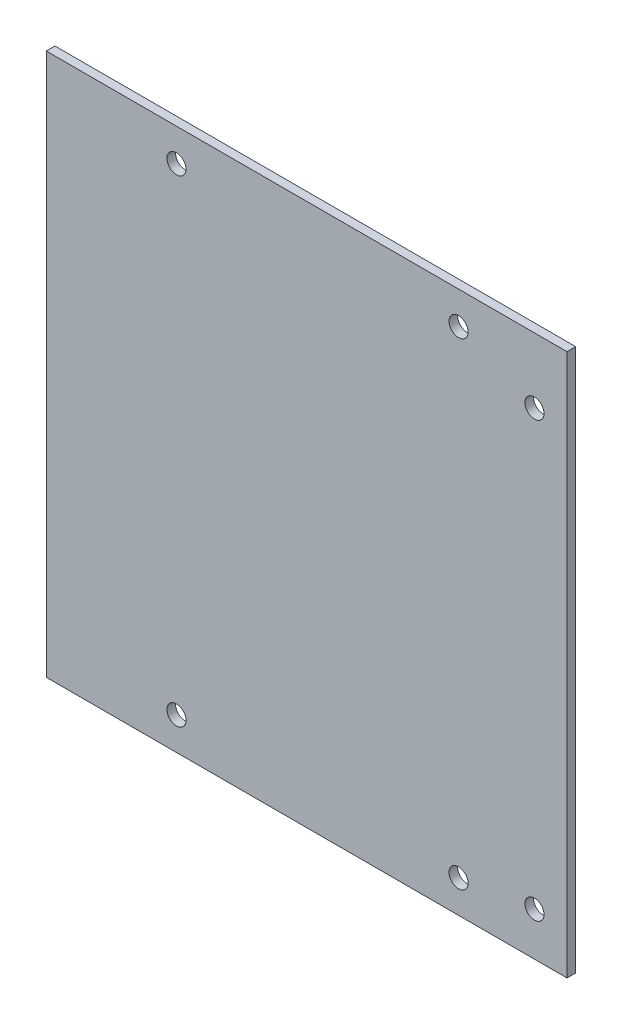
ISO-10303-21;
HEADER;
FILE_DESCRIPTION(('STEP AP214'),'2;1');
FILE_NAME('part.step','',(''),(''),'','','');
FILE_SCHEMA(('AUTOMOTIVE_DESIGN { 1 0 10303 214 1 1 1 1 }'));
ENDSEC;
DATA;
#1=APPLICATION_CONTEXT('core data for automotive mechanical design processes');
#2=APPLICATION_PROTOCOL_DEFINITION('international standard','automotive_design',2000,#1);
#3=PRODUCT_CONTEXT('',#1,'mechanical');
#4=PRODUCT('Part','Part','',(#3));
#5=PRODUCT_RELATED_PRODUCT_CATEGORY('part','',(#4));
#6=PRODUCT_DEFINITION_FORMATION('','',#4);
#7=PRODUCT_DEFINITION_CONTEXT('part definition',#1,'design');
#8=PRODUCT_DEFINITION('design','',#6,#7);
#9=PRODUCT_DEFINITION_SHAPE('','',#8);
#10=(LENGTH_UNIT() NAMED_UNIT(*) SI_UNIT(.MILLI.,.METRE.));
#11=(NAMED_UNIT(*) PLANE_ANGLE_UNIT() SI_UNIT($,.RADIAN.));
#12=(NAMED_UNIT(*) SI_UNIT($,.STERADIAN.) SOLID_ANGLE_UNIT());
#13=UNCERTAINTY_MEASURE_WITH_UNIT(LENGTH_MEASURE(1.E-05),#10,'distance_accuracy_value','');
#14=(GEOMETRIC_REPRESENTATION_CONTEXT(3) GLOBAL_UNCERTAINTY_ASSIGNED_CONTEXT((#13)) GLOBAL_UNIT_ASSIGNED_CONTEXT((#10,
#11,#12)) REPRESENTATION_CONTEXT('',''));
#15=CARTESIAN_POINT('',(0.,0.,0.));
#16=DIRECTION('',(0.,0.,1.));
#17=DIRECTION('',(1.,0.,0.));
#18=AXIS2_PLACEMENT_3D('',#15,#16,#17);
#19=CARTESIAN_POINT('',(70.,62.5,2.));
#20=DIRECTION('',(-1.,0.,0.));
#21=DIRECTION('',(0.,-1.,0.));
#22=AXIS2_PLACEMENT_3D('',#19,#20,#21);
#23=PLANE('',#22);
#24=DIRECTION('',(0.,1.,0.));
#25=VECTOR('',#24,1.);
#26=CARTESIAN_POINT('',(70.,62.5,0.));
#27=LINE('',#26,#25);
#28=CARTESIAN_POINT('',(70.,-62.5,0.));
#29=VERTEX_POINT('',#28);
#30=CARTESIAN_POINT('',(70.,62.5,0.));
#31=VERTEX_POINT('',#30);
#32=EDGE_CURVE('E95',#29,#31,#27,.T.);
#33=ORIENTED_EDGE('',*,*,#32,.T.);
#34=DIRECTION('',(0.,0.,-1.));
#35=VECTOR('',#34,1.);
#36=CARTESIAN_POINT('',(70.,62.5,2.));
#37=LINE('',#36,#35);
#38=CARTESIAN_POINT('',(70.,62.5,2.));
#39=VERTEX_POINT('',#38);
#40=EDGE_CURVE('E11',#39,#31,#37,.T.);
#41=ORIENTED_EDGE('',*,*,#40,.F.);
#42=DIRECTION('',(0.,1.,0.));
#43=VECTOR('',#42,1.);
#44=CARTESIAN_POINT('',(70.,62.5,2.));
#45=LINE('',#44,#43);
#46=CARTESIAN_POINT('',(70.,-62.5,2.));
#47=VERTEX_POINT('',#46);
#48=EDGE_CURVE('E89',#47,#39,#45,.T.);
#49=ORIENTED_EDGE('',*,*,#48,.F.);
#50=DIRECTION('',(0.,0.,-1.));
#51=VECTOR('',#50,1.);
#52=CARTESIAN_POINT('',(70.,-62.5,2.));
#53=LINE('',#52,#51);
#54=EDGE_CURVE('E48',#47,#29,#53,.T.);
#55=ORIENTED_EDGE('',*,*,#54,.T.);
#56=EDGE_LOOP('',(#33,#41,#49,#55));
#57=FACE_BOUND('',#56,.T.);
#58=ADVANCED_FACE('F39',(#57),#23,.F.);
#59=CARTESIAN_POINT('',(-70.,62.5,2.));
#60=DIRECTION('',(0.,-1.,0.));
#61=DIRECTION('',(0.,0.,-1.));
#62=AXIS2_PLACEMENT_3D('',#59,#60,#61);
#63=PLANE('',#62);
#64=DIRECTION('',(-1.,0.,0.));
#65=VECTOR('',#64,1.);
#66=CARTESIAN_POINT('',(-70.,62.5,0.));
#67=LINE('',#66,#65);
#68=CARTESIAN_POINT('',(-50.,62.5,0.));
#69=VERTEX_POINT('',#68);
#70=EDGE_CURVE('E90',#31,#69,#67,.T.);
#71=ORIENTED_EDGE('',*,*,#70,.T.);
#72=DIRECTION('',(0.,0.,-1.));
#73=VECTOR('',#72,1.);
#74=CARTESIAN_POINT('',(-50.,62.5,2.));
#75=LINE('',#74,#73);
#76=CARTESIAN_POINT('',(-50.,62.5,2.));
#77=VERTEX_POINT('',#76);
#78=EDGE_CURVE('E56',#77,#69,#75,.T.);
#79=ORIENTED_EDGE('',*,*,#78,.F.);
#80=DIRECTION('',(-1.,0.,0.));
#81=VECTOR('',#80,1.);
#82=CARTESIAN_POINT('',(-70.,62.5,2.));
#83=LINE('',#82,#81);
#84=EDGE_CURVE('E142',#39,#77,#83,.T.);
#85=ORIENTED_EDGE('',*,*,#84,.F.);
#86=ORIENTED_EDGE('',*,*,#40,.T.);
#87=EDGE_LOOP('',(#71,#79,#85,#86));
#88=FACE_BOUND('',#87,.T.);
#89=ADVANCED_FACE('F152',(#88),#63,.F.);
#90=CARTESIAN_POINT('',(-70.,-62.5,2.));
#91=DIRECTION('',(0.,1.,0.));
#92=DIRECTION('',(0.,0.,1.));
#93=AXIS2_PLACEMENT_3D('',#90,#91,#92);
#94=PLANE('',#93);
#95=DIRECTION('',(1.,0.,0.));
#96=VECTOR('',#95,1.);
#97=CARTESIAN_POINT('',(-70.,-62.5,2.));
#98=LINE('',#97,#96);
#99=CARTESIAN_POINT('',(-50.,-62.5,2.00000000000002));
#100=VERTEX_POINT('',#99);
#101=EDGE_CURVE('E65',#100,#47,#98,.T.);
#102=ORIENTED_EDGE('',*,*,#101,.F.);
#103=DIRECTION('',(0.,0.,1.));
#104=VECTOR('',#103,1.);
#105=CARTESIAN_POINT('',(-50.,-62.5,2.00000000000002));
#106=LINE('',#105,#104);
#107=CARTESIAN_POINT('',(-50.,-62.5,0.));
#108=VERTEX_POINT('',#107);
#109=EDGE_CURVE('E85',#108,#100,#106,.T.);
#110=ORIENTED_EDGE('',*,*,#109,.F.);
#111=DIRECTION('',(1.,0.,0.));
#112=VECTOR('',#111,1.);
#113=CARTESIAN_POINT('',(-70.,-62.5,0.));
#114=LINE('',#113,#112);
#115=EDGE_CURVE('E79',#108,#29,#114,.T.);
#116=ORIENTED_EDGE('',*,*,#115,.T.);
#117=ORIENTED_EDGE('',*,*,#54,.F.);
#118=EDGE_LOOP('',(#102,#110,#116,#117));
#119=FACE_BOUND('',#118,.T.);
#120=ADVANCED_FACE('F81',(#119),#94,.F.);
#121=CARTESIAN_POINT('',(0.,0.,2.));
#122=DIRECTION('',(0.,0.,1.));
#123=DIRECTION('',(1.,0.,0.));
#124=AXIS2_PLACEMENT_3D('',#121,#122,#123);
#125=PLANE('',#124);
#126=DIRECTION('',(0.,1.,0.));
#127=VECTOR('',#126,1.);
#128=CARTESIAN_POINT('',(-50.,62.5,2.));
#129=LINE('',#128,#127);
#130=EDGE_CURVE('E149',#100,#77,#129,.T.);
#131=ORIENTED_EDGE('',*,*,#130,.F.);
#132=ORIENTED_EDGE('',*,*,#101,.T.);
#133=ORIENTED_EDGE('',*,*,#48,.T.);
#134=ORIENTED_EDGE('',*,*,#84,.T.);
#135=EDGE_LOOP('',(#131,#132,#133,#134));
#136=FACE_BOUND('',#135,.T.);
#137=CARTESIAN_POINT('',(-20.,55.,2.));
#138=DIRECTION('',(0.,0.,1.));
#139=DIRECTION('',(1.,0.,0.));
#140=AXIS2_PLACEMENT_3D('',#137,#138,#139);
#141=CIRCLE('',#140,2.20000000000001);
#142=CARTESIAN_POINT('',(-17.8,55.,2.));
#143=VERTEX_POINT('',#142);
#144=EDGE_CURVE('E168',#143,#143,#141,.T.);
#145=ORIENTED_EDGE('',*,*,#144,.F.);
#146=EDGE_LOOP('',(#145));
#147=FACE_BOUND('',#146,.T.);
#148=CARTESIAN_POINT('',(45.,-55.,2.));
#149=DIRECTION('',(0.,0.,1.));
#150=DIRECTION('',(1.,0.,0.));
#151=AXIS2_PLACEMENT_3D('',#148,#149,#150);
#152=CIRCLE('',#151,2.2);
#153=CARTESIAN_POINT('',(47.2,-55.,2.));
#154=VERTEX_POINT('',#153);
#155=EDGE_CURVE('E167',#154,#154,#152,.T.);
#156=ORIENTED_EDGE('',*,*,#155,.F.);
#157=EDGE_LOOP('',(#156));
#158=FACE_BOUND('',#157,.T.);
#159=CARTESIAN_POINT('',(-20.,-55.,2.));
#160=DIRECTION('',(0.,0.,1.));
#161=DIRECTION('',(1.,0.,0.));
#162=AXIS2_PLACEMENT_3D('',#159,#160,#161);
#163=CIRCLE('',#162,2.2);
#164=CARTESIAN_POINT('',(-17.8,-55.,2.));
#165=VERTEX_POINT('',#164);
#166=EDGE_CURVE('E163',#165,#165,#163,.T.);
#167=ORIENTED_EDGE('',*,*,#166,.F.);
#168=EDGE_LOOP('',(#167));
#169=FACE_BOUND('',#168,.T.);
#170=CARTESIAN_POINT('',(45.,55.,2.));
#171=DIRECTION('',(0.,0.,1.));
#172=DIRECTION('',(1.,0.,0.));
#173=AXIS2_PLACEMENT_3D('',#170,#171,#172);
#174=CIRCLE('',#173,2.20000000000001);
#175=CARTESIAN_POINT('',(47.2,55.,2.));
#176=VERTEX_POINT('',#175);
#177=EDGE_CURVE('E117',#176,#176,#174,.T.);
#178=ORIENTED_EDGE('',*,*,#177,.F.);
#179=EDGE_LOOP('',(#178));
#180=FACE_BOUND('',#179,.T.);
#181=CARTESIAN_POINT('',(62.5,47.5,2.));
#182=DIRECTION('',(0.,0.,1.));
#183=DIRECTION('',(1.,0.,0.));
#184=AXIS2_PLACEMENT_3D('',#181,#182,#183);
#185=CIRCLE('',#184,2.2);
#186=CARTESIAN_POINT('',(64.7,47.5,2.));
#187=VERTEX_POINT('',#186);
#188=EDGE_CURVE('E107',#187,#187,#185,.T.);
#189=ORIENTED_EDGE('',*,*,#188,.F.);
#190=EDGE_LOOP('',(#189));
#191=FACE_BOUND('',#190,.T.);
#192=CARTESIAN_POINT('',(62.5,-52.5,2.));
#193=DIRECTION('',(0.,0.,1.));
#194=DIRECTION('',(1.,0.,0.));
#195=AXIS2_PLACEMENT_3D('',#192,#193,#194);
#196=CIRCLE('',#195,2.2);
#197=CARTESIAN_POINT('',(64.7,-52.5,2.));
#198=VERTEX_POINT('',#197);
#199=EDGE_CURVE('E127',#198,#198,#196,.T.);
#200=ORIENTED_EDGE('',*,*,#199,.F.);
#201=EDGE_LOOP('',(#200));
#202=FACE_BOUND('',#201,.T.);
#203=ADVANCED_FACE('F147',(#136,#147,#158,#169,#180,#191,#202),#125,.T.);
#204=CARTESIAN_POINT('',(0.,0.,0.));
#205=DIRECTION('',(0.,0.,1.));
#206=DIRECTION('',(1.,0.,0.));
#207=AXIS2_PLACEMENT_3D('',#204,#205,#206);
#208=PLANE('',#207);
#209=CARTESIAN_POINT('',(-20.,55.,0.));
#210=DIRECTION('',(0.,0.,1.));
#211=DIRECTION('',(1.,0.,0.));
#212=AXIS2_PLACEMENT_3D('',#209,#210,#211);
#213=CIRCLE('',#212,2.20000000000001);
#214=CARTESIAN_POINT('',(-17.8,55.,0.));
#215=VERTEX_POINT('',#214);
#216=EDGE_CURVE('E42',#215,#215,#213,.T.);
#217=ORIENTED_EDGE('',*,*,#216,.T.);
#218=EDGE_LOOP('',(#217));
#219=FACE_BOUND('',#218,.T.);
#220=CARTESIAN_POINT('',(45.,-55.,0.));
#221=DIRECTION('',(0.,0.,1.));
#222=DIRECTION('',(1.,0.,0.));
#223=AXIS2_PLACEMENT_3D('',#220,#221,#222);
#224=CIRCLE('',#223,2.2);
#225=CARTESIAN_POINT('',(47.2,-55.,0.));
#226=VERTEX_POINT('',#225);
#227=EDGE_CURVE('E120',#226,#226,#224,.T.);
#228=ORIENTED_EDGE('',*,*,#227,.T.);
#229=EDGE_LOOP('',(#228));
#230=FACE_BOUND('',#229,.T.);
#231=CARTESIAN_POINT('',(-20.,-55.,0.));
#232=DIRECTION('',(0.,0.,1.));
#233=DIRECTION('',(1.,0.,0.));
#234=AXIS2_PLACEMENT_3D('',#231,#232,#233);
#235=CIRCLE('',#234,2.2);
#236=CARTESIAN_POINT('',(-17.8,-55.,0.));
#237=VERTEX_POINT('',#236);
#238=EDGE_CURVE('E116',#237,#237,#235,.T.);
#239=ORIENTED_EDGE('',*,*,#238,.T.);
#240=EDGE_LOOP('',(#239));
#241=FACE_BOUND('',#240,.T.);
#242=CARTESIAN_POINT('',(45.,55.,0.));
#243=DIRECTION('',(0.,0.,1.));
#244=DIRECTION('',(1.,0.,0.));
#245=AXIS2_PLACEMENT_3D('',#242,#243,#244);
#246=CIRCLE('',#245,2.20000000000001);
#247=CARTESIAN_POINT('',(47.2,55.,0.));
#248=VERTEX_POINT('',#247);
#249=EDGE_CURVE('E112',#248,#248,#246,.T.);
#250=ORIENTED_EDGE('',*,*,#249,.T.);
#251=EDGE_LOOP('',(#250));
#252=FACE_BOUND('',#251,.T.);
#253=CARTESIAN_POINT('',(62.5,47.5,0.));
#254=DIRECTION('',(0.,0.,1.));
#255=DIRECTION('',(1.,0.,0.));
#256=AXIS2_PLACEMENT_3D('',#253,#254,#255);
#257=CIRCLE('',#256,2.2);
#258=CARTESIAN_POINT('',(64.7,47.5,0.));
#259=VERTEX_POINT('',#258);
#260=EDGE_CURVE('E101',#259,#259,#257,.T.);
#261=ORIENTED_EDGE('',*,*,#260,.T.);
#262=EDGE_LOOP('',(#261));
#263=FACE_BOUND('',#262,.T.);
#264=CARTESIAN_POINT('',(62.5,-52.5,0.));
#265=DIRECTION('',(0.,0.,1.));
#266=DIRECTION('',(1.,0.,0.));
#267=AXIS2_PLACEMENT_3D('',#264,#265,#266);
#268=CIRCLE('',#267,2.2);
#269=CARTESIAN_POINT('',(64.7,-52.5,0.));
#270=VERTEX_POINT('',#269);
#271=EDGE_CURVE('E132',#270,#270,#268,.T.);
#272=ORIENTED_EDGE('',*,*,#271,.T.);
#273=EDGE_LOOP('',(#272));
#274=FACE_BOUND('',#273,.T.);
#275=ORIENTED_EDGE('',*,*,#115,.F.);
#276=DIRECTION('',(0.,-1.,0.));
#277=VECTOR('',#276,1.);
#278=CARTESIAN_POINT('',(-50.,62.5,0.));
#279=LINE('',#278,#277);
#280=EDGE_CURVE('E154',#69,#108,#279,.T.);
#281=ORIENTED_EDGE('',*,*,#280,.F.);
#282=ORIENTED_EDGE('',*,*,#70,.F.);
#283=ORIENTED_EDGE('',*,*,#32,.F.);
#284=EDGE_LOOP('',(#275,#281,#282,#283));
#285=FACE_BOUND('',#284,.T.);
#286=ADVANCED_FACE('F98',(#219,#230,#241,#252,#263,#274,#285),#208,.F.);
#287=CARTESIAN_POINT('',(62.5,-52.5,0.));
#288=DIRECTION('',(0.,0.,1.));
#289=DIRECTION('',(1.,0.,0.));
#290=AXIS2_PLACEMENT_3D('',#287,#288,#289);
#291=CYLINDRICAL_SURFACE('',#290,2.2);
#292=ORIENTED_EDGE('',*,*,#271,.F.);
#293=EDGE_LOOP('',(#292));
#294=FACE_BOUND('',#293,.T.);
#295=ORIENTED_EDGE('',*,*,#199,.T.);
#296=EDGE_LOOP('',(#295));
#297=FACE_BOUND('',#296,.T.);
#298=ADVANCED_FACE('F190',(#294,#297),#291,.F.);
#299=CARTESIAN_POINT('',(62.5,47.5,0.));
#300=DIRECTION('',(0.,0.,1.));
#301=DIRECTION('',(1.,0.,0.));
#302=AXIS2_PLACEMENT_3D('',#299,#300,#301);
#303=CYLINDRICAL_SURFACE('',#302,2.2);
#304=ORIENTED_EDGE('',*,*,#260,.F.);
#305=EDGE_LOOP('',(#304));
#306=FACE_BOUND('',#305,.T.);
#307=ORIENTED_EDGE('',*,*,#188,.T.);
#308=EDGE_LOOP('',(#307));
#309=FACE_BOUND('',#308,.T.);
#310=ADVANCED_FACE('F181',(#306,#309),#303,.F.);
#311=CARTESIAN_POINT('',(45.,55.,-103.));
#312=DIRECTION('',(0.,0.,1.));
#313=DIRECTION('',(1.,0.,0.));
#314=AXIS2_PLACEMENT_3D('',#311,#312,#313);
#315=CYLINDRICAL_SURFACE('',#314,2.20000000000001);
#316=ORIENTED_EDGE('',*,*,#177,.T.);
#317=EDGE_LOOP('',(#316));
#318=FACE_BOUND('',#317,.T.);
#319=ORIENTED_EDGE('',*,*,#249,.F.);
#320=EDGE_LOOP('',(#319));
#321=FACE_BOUND('',#320,.T.);
#322=ADVANCED_FACE('F250',(#318,#321),#315,.F.);
#323=CARTESIAN_POINT('',(-20.,-55.,-103.));
#324=DIRECTION('',(0.,0.,1.));
#325=DIRECTION('',(1.,0.,0.));
#326=AXIS2_PLACEMENT_3D('',#323,#324,#325);
#327=CYLINDRICAL_SURFACE('',#326,2.2);
#328=ORIENTED_EDGE('',*,*,#166,.T.);
#329=EDGE_LOOP('',(#328));
#330=FACE_BOUND('',#329,.T.);
#331=ORIENTED_EDGE('',*,*,#238,.F.);
#332=EDGE_LOOP('',(#331));
#333=FACE_BOUND('',#332,.T.);
#334=ADVANCED_FACE('F242',(#330,#333),#327,.F.);
#335=CARTESIAN_POINT('',(45.,-55.,-103.));
#336=DIRECTION('',(0.,0.,1.));
#337=DIRECTION('',(1.,0.,0.));
#338=AXIS2_PLACEMENT_3D('',#335,#336,#337);
#339=CYLINDRICAL_SURFACE('',#338,2.2);
#340=ORIENTED_EDGE('',*,*,#155,.T.);
#341=EDGE_LOOP('',(#340));
#342=FACE_BOUND('',#341,.T.);
#343=ORIENTED_EDGE('',*,*,#227,.F.);
#344=EDGE_LOOP('',(#343));
#345=FACE_BOUND('',#344,.T.);
#346=ADVANCED_FACE('F235',(#342,#345),#339,.F.);
#347=CARTESIAN_POINT('',(-20.,55.,-103.));
#348=DIRECTION('',(0.,0.,1.));
#349=DIRECTION('',(1.,0.,0.));
#350=AXIS2_PLACEMENT_3D('',#347,#348,#349);
#351=CYLINDRICAL_SURFACE('',#350,2.20000000000001);
#352=ORIENTED_EDGE('',*,*,#144,.T.);
#353=EDGE_LOOP('',(#352));
#354=FACE_BOUND('',#353,.T.);
#355=ORIENTED_EDGE('',*,*,#216,.F.);
#356=EDGE_LOOP('',(#355));
#357=FACE_BOUND('',#356,.T.);
#358=ADVANCED_FACE('F226',(#354,#357),#351,.F.);
#359=CARTESIAN_POINT('',(-50.,0.,0.));
#360=DIRECTION('',(1.,0.,0.));
#361=DIRECTION('',(0.,1.,0.));
#362=AXIS2_PLACEMENT_3D('',#359,#360,#361);
#363=PLANE('',#362);
#364=ORIENTED_EDGE('',*,*,#130,.T.);
#365=ORIENTED_EDGE('',*,*,#78,.T.);
#366=ORIENTED_EDGE('',*,*,#280,.T.);
#367=ORIENTED_EDGE('',*,*,#109,.T.);
#368=EDGE_LOOP('',(#364,#365,#366,#367));
#369=FACE_BOUND('',#368,.T.);
#370=ADVANCED_FACE('F222',(#369),#363,.F.);
#371=CLOSED_SHELL('',(#58,#89,#120,#203,#286,#298,#310,#322,#334,#346,#358,#370));
#372=MANIFOLD_SOLID_BREP('B2',#371);
#373=ADVANCED_BREP_SHAPE_REPRESENTATION('',(#18,#372),#14);
#374=SHAPE_DEFINITION_REPRESENTATION(#9,#373);
ENDSEC;
END-ISO-10303-21;
